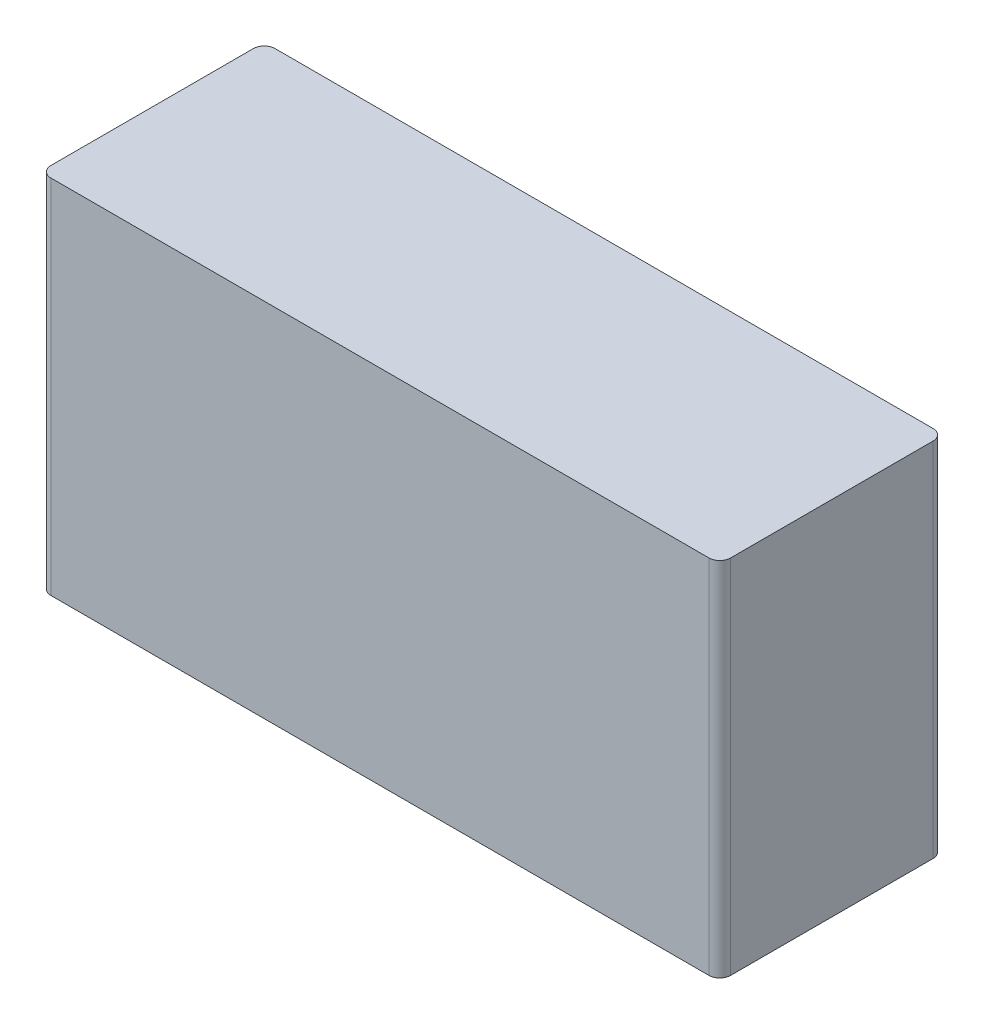
ISO-10303-21;
HEADER;
FILE_DESCRIPTION(('STEP AP214'),'2;1');
FILE_NAME('part.step','',(''),(''),'','','');
FILE_SCHEMA(('AUTOMOTIVE_DESIGN { 1 0 10303 214 1 1 1 1 }'));
ENDSEC;
DATA;
#1=APPLICATION_CONTEXT('core data for automotive mechanical design processes');
#2=APPLICATION_PROTOCOL_DEFINITION('international standard','automotive_design',2000,#1);
#3=PRODUCT_CONTEXT('',#1,'mechanical');
#4=PRODUCT('Part','Part','',(#3));
#5=PRODUCT_RELATED_PRODUCT_CATEGORY('part','',(#4));
#6=PRODUCT_DEFINITION_FORMATION('','',#4);
#7=PRODUCT_DEFINITION_CONTEXT('part definition',#1,'design');
#8=PRODUCT_DEFINITION('design','',#6,#7);
#9=PRODUCT_DEFINITION_SHAPE('','',#8);
#10=(LENGTH_UNIT() NAMED_UNIT(*) SI_UNIT(.MILLI.,.METRE.));
#11=(NAMED_UNIT(*) PLANE_ANGLE_UNIT() SI_UNIT($,.RADIAN.));
#12=(NAMED_UNIT(*) SI_UNIT($,.STERADIAN.) SOLID_ANGLE_UNIT());
#13=UNCERTAINTY_MEASURE_WITH_UNIT(LENGTH_MEASURE(1.E-05),#10,'distance_accuracy_value','');
#14=(GEOMETRIC_REPRESENTATION_CONTEXT(3) GLOBAL_UNCERTAINTY_ASSIGNED_CONTEXT((#13)) GLOBAL_UNIT_ASSIGNED_CONTEXT((#10,
#11,#12)) REPRESENTATION_CONTEXT('',''));
#15=CARTESIAN_POINT('',(0.,0.,0.));
#16=DIRECTION('',(0.,0.,1.));
#17=DIRECTION('',(1.,0.,0.));
#18=AXIS2_PLACEMENT_3D('',#15,#16,#17);
#19=CARTESIAN_POINT('',(0.,-0.25,0.185));
#20=DIRECTION('',(0.,1.,0.));
#21=DIRECTION('',(0.,0.,1.));
#22=AXIS2_PLACEMENT_3D('',#19,#20,#21);
#23=PLANE('',#22);
#24=DIRECTION('',(-1.,0.,0.));
#25=VECTOR('',#24,1.);
#26=CARTESIAN_POINT('',(-0.455,-0.25,0.340000000000001));
#27=LINE('',#26,#25);
#28=CARTESIAN_POINT('',(0.455,-0.25,0.34));
#29=VERTEX_POINT('',#28);
#30=CARTESIAN_POINT('',(-0.455,-0.25,0.340000000000001));
#31=VERTEX_POINT('',#30);
#32=EDGE_CURVE('E11',#29,#31,#27,.T.);
#33=ORIENTED_EDGE('',*,*,#32,.T.);
#34=CARTESIAN_POINT('',(-0.455,-0.25,0.325000000000001));
#35=DIRECTION('',(0.,-1.,0.));
#36=DIRECTION('',(-1.,0.,0.));
#37=AXIS2_PLACEMENT_3D('',#34,#35,#36);
#38=CIRCLE('',#37,0.015);
#39=CARTESIAN_POINT('',(-0.47,-0.25,0.325000000000001));
#40=VERTEX_POINT('',#39);
#41=EDGE_CURVE('E24',#31,#40,#38,.T.);
#42=ORIENTED_EDGE('',*,*,#41,.T.);
#43=DIRECTION('',(0.,0.,-1.));
#44=VECTOR('',#43,1.);
#45=CARTESIAN_POINT('',(-0.470000000000001,-0.25,0.045));
#46=LINE('',#45,#44);
#47=CARTESIAN_POINT('',(-0.470000000000001,-0.25,0.045));
#48=VERTEX_POINT('',#47);
#49=EDGE_CURVE('E141',#40,#48,#46,.T.);
#50=ORIENTED_EDGE('',*,*,#49,.T.);
#51=CARTESIAN_POINT('',(-0.455000000000001,-0.25,0.045));
#52=DIRECTION('',(0.,-1.,0.));
#53=DIRECTION('',(0.,0.,-1.));
#54=AXIS2_PLACEMENT_3D('',#51,#52,#53);
#55=CIRCLE('',#54,0.015);
#56=CARTESIAN_POINT('',(-0.455000000000001,-0.25,0.03));
#57=VERTEX_POINT('',#56);
#58=EDGE_CURVE('E139',#48,#57,#55,.T.);
#59=ORIENTED_EDGE('',*,*,#58,.T.);
#60=DIRECTION('',(1.,0.,0.));
#61=VECTOR('',#60,1.);
#62=CARTESIAN_POINT('',(0.455,-0.25,0.0299999999999999));
#63=LINE('',#62,#61);
#64=CARTESIAN_POINT('',(0.455,-0.25,0.0299999999999999));
#65=VERTEX_POINT('',#64);
#66=EDGE_CURVE('E137',#57,#65,#63,.T.);
#67=ORIENTED_EDGE('',*,*,#66,.T.);
#68=CARTESIAN_POINT('',(0.455,-0.25,0.0449999999999999));
#69=DIRECTION('',(0.,-1.,0.));
#70=DIRECTION('',(1.,0.,0.));
#71=AXIS2_PLACEMENT_3D('',#68,#69,#70);
#72=CIRCLE('',#71,0.015);
#73=CARTESIAN_POINT('',(0.47,-0.25,0.0449999999999999));
#74=VERTEX_POINT('',#73);
#75=EDGE_CURVE('E135',#65,#74,#72,.T.);
#76=ORIENTED_EDGE('',*,*,#75,.T.);
#77=DIRECTION('',(0.,0.,1.));
#78=VECTOR('',#77,1.);
#79=CARTESIAN_POINT('',(0.47,-0.25,0.325));
#80=LINE('',#79,#78);
#81=CARTESIAN_POINT('',(0.47,-0.25,0.325));
#82=VERTEX_POINT('',#81);
#83=EDGE_CURVE('E133',#74,#82,#80,.T.);
#84=ORIENTED_EDGE('',*,*,#83,.T.);
#85=CARTESIAN_POINT('',(0.455,-0.25,0.325));
#86=DIRECTION('',(0.,-1.,0.));
#87=DIRECTION('',(0.,0.,1.));
#88=AXIS2_PLACEMENT_3D('',#85,#86,#87);
#89=CIRCLE('',#88,0.015);
#90=EDGE_CURVE('E131',#82,#29,#89,.T.);
#91=ORIENTED_EDGE('',*,*,#90,.T.);
#92=EDGE_LOOP('',(#33,#42,#50,#59,#67,#76,#84,#91));
#93=FACE_BOUND('',#92,.T.);
#94=ADVANCED_FACE('F17',(#93),#23,.F.);
#95=CARTESIAN_POINT('',(-0.455,0.,0.325000000000001));
#96=DIRECTION('',(0.,1.,0.));
#97=DIRECTION('',(-1.,0.,0.));
#98=AXIS2_PLACEMENT_3D('',#95,#96,#97);
#99=CYLINDRICAL_SURFACE('',#98,0.015);
#100=DIRECTION('',(0.,-1.,0.));
#101=VECTOR('',#100,1.);
#102=CARTESIAN_POINT('',(-0.455,0.,0.340000000000001));
#103=LINE('',#102,#101);
#104=CARTESIAN_POINT('',(-0.455,0.25,0.340000000000001));
#105=VERTEX_POINT('',#104);
#106=EDGE_CURVE('E129',#105,#31,#103,.T.);
#107=ORIENTED_EDGE('',*,*,#106,.F.);
#108=CARTESIAN_POINT('',(-0.455,0.25,0.325000000000001));
#109=DIRECTION('',(0.,1.,0.));
#110=DIRECTION('',(-1.,0.,0.));
#111=AXIS2_PLACEMENT_3D('',#108,#109,#110);
#112=CIRCLE('',#111,0.015);
#113=CARTESIAN_POINT('',(-0.47,0.25,0.325000000000001));
#114=VERTEX_POINT('',#113);
#115=EDGE_CURVE('E96',#114,#105,#112,.T.);
#116=ORIENTED_EDGE('',*,*,#115,.F.);
#117=DIRECTION('',(0.,1.,0.));
#118=VECTOR('',#117,1.);
#119=CARTESIAN_POINT('',(-0.47,0.,0.325000000000001));
#120=LINE('',#119,#118);
#121=EDGE_CURVE('E125',#40,#114,#120,.T.);
#122=ORIENTED_EDGE('',*,*,#121,.F.);
#123=ORIENTED_EDGE('',*,*,#41,.F.);
#124=EDGE_LOOP('',(#107,#116,#122,#123));
#125=FACE_BOUND('',#124,.T.);
#126=ADVANCED_FACE('F149',(#125),#99,.T.);
#127=CARTESIAN_POINT('',(-0.470000000000001,0.,0.045));
#128=DIRECTION('',(-1.,0.,0.));
#129=DIRECTION('',(0.,0.,1.));
#130=AXIS2_PLACEMENT_3D('',#127,#128,#129);
#131=PLANE('',#130);
#132=ORIENTED_EDGE('',*,*,#121,.T.);
#133=DIRECTION('',(0.,0.,1.));
#134=VECTOR('',#133,1.);
#135=CARTESIAN_POINT('',(-0.470000000000001,0.25,0.045));
#136=LINE('',#135,#134);
#137=CARTESIAN_POINT('',(-0.470000000000001,0.25,0.045));
#138=VERTEX_POINT('',#137);
#139=EDGE_CURVE('E123',#138,#114,#136,.T.);
#140=ORIENTED_EDGE('',*,*,#139,.F.);
#141=DIRECTION('',(0.,1.,0.));
#142=VECTOR('',#141,1.);
#143=CARTESIAN_POINT('',(-0.470000000000001,0.,0.045));
#144=LINE('',#143,#142);
#145=EDGE_CURVE('E120',#48,#138,#144,.T.);
#146=ORIENTED_EDGE('',*,*,#145,.F.);
#147=ORIENTED_EDGE('',*,*,#49,.F.);
#148=EDGE_LOOP('',(#132,#140,#146,#147));
#149=FACE_BOUND('',#148,.T.);
#150=ADVANCED_FACE('F148',(#149),#131,.T.);
#151=CARTESIAN_POINT('',(-0.455000000000001,0.,0.045));
#152=DIRECTION('',(0.,1.,0.));
#153=DIRECTION('',(0.,0.,-1.));
#154=AXIS2_PLACEMENT_3D('',#151,#152,#153);
#155=CYLINDRICAL_SURFACE('',#154,0.015);
#156=ORIENTED_EDGE('',*,*,#145,.T.);
#157=CARTESIAN_POINT('',(-0.455000000000001,0.25,0.045));
#158=DIRECTION('',(0.,1.,0.));
#159=DIRECTION('',(0.,0.,-1.));
#160=AXIS2_PLACEMENT_3D('',#157,#158,#159);
#161=CIRCLE('',#160,0.015);
#162=CARTESIAN_POINT('',(-0.455000000000001,0.25,0.03));
#163=VERTEX_POINT('',#162);
#164=EDGE_CURVE('E117',#163,#138,#161,.T.);
#165=ORIENTED_EDGE('',*,*,#164,.F.);
#166=DIRECTION('',(0.,1.,0.));
#167=VECTOR('',#166,1.);
#168=CARTESIAN_POINT('',(-0.455000000000001,0.,0.03));
#169=LINE('',#168,#167);
#170=EDGE_CURVE('E114',#57,#163,#169,.T.);
#171=ORIENTED_EDGE('',*,*,#170,.F.);
#172=ORIENTED_EDGE('',*,*,#58,.F.);
#173=EDGE_LOOP('',(#156,#165,#171,#172));
#174=FACE_BOUND('',#173,.T.);
#175=ADVANCED_FACE('F156',(#174),#155,.T.);
#176=CARTESIAN_POINT('',(0.455,0.,0.0299999999999999));
#177=DIRECTION('',(0.,0.,-1.));
#178=DIRECTION('',(-1.,0.,0.));
#179=AXIS2_PLACEMENT_3D('',#176,#177,#178);
#180=PLANE('',#179);
#181=ORIENTED_EDGE('',*,*,#170,.T.);
#182=DIRECTION('',(-1.,0.,0.));
#183=VECTOR('',#182,1.);
#184=CARTESIAN_POINT('',(0.455,0.25,0.0299999999999999));
#185=LINE('',#184,#183);
#186=CARTESIAN_POINT('',(0.455,0.25,0.0299999999999999));
#187=VERTEX_POINT('',#186);
#188=EDGE_CURVE('E111',#187,#163,#185,.T.);
#189=ORIENTED_EDGE('',*,*,#188,.F.);
#190=DIRECTION('',(0.,1.,0.));
#191=VECTOR('',#190,1.);
#192=CARTESIAN_POINT('',(0.455,0.,0.0299999999999999));
#193=LINE('',#192,#191);
#194=EDGE_CURVE('E108',#65,#187,#193,.T.);
#195=ORIENTED_EDGE('',*,*,#194,.F.);
#196=ORIENTED_EDGE('',*,*,#66,.F.);
#197=EDGE_LOOP('',(#181,#189,#195,#196));
#198=FACE_BOUND('',#197,.T.);
#199=ADVANCED_FACE('F161',(#198),#180,.T.);
#200=CARTESIAN_POINT('',(0.455,0.,0.0449999999999999));
#201=DIRECTION('',(0.,1.,0.));
#202=DIRECTION('',(1.,0.,0.));
#203=AXIS2_PLACEMENT_3D('',#200,#201,#202);
#204=CYLINDRICAL_SURFACE('',#203,0.015);
#205=ORIENTED_EDGE('',*,*,#194,.T.);
#206=CARTESIAN_POINT('',(0.455,0.25,0.0449999999999999));
#207=DIRECTION('',(0.,1.,0.));
#208=DIRECTION('',(1.,0.,0.));
#209=AXIS2_PLACEMENT_3D('',#206,#207,#208);
#210=CIRCLE('',#209,0.015);
#211=CARTESIAN_POINT('',(0.47,0.25,0.0449999999999999));
#212=VERTEX_POINT('',#211);
#213=EDGE_CURVE('E105',#212,#187,#210,.T.);
#214=ORIENTED_EDGE('',*,*,#213,.F.);
#215=DIRECTION('',(0.,1.,0.));
#216=VECTOR('',#215,1.);
#217=CARTESIAN_POINT('',(0.47,0.,0.0449999999999999));
#218=LINE('',#217,#216);
#219=EDGE_CURVE('E102',#74,#212,#218,.T.);
#220=ORIENTED_EDGE('',*,*,#219,.F.);
#221=ORIENTED_EDGE('',*,*,#75,.F.);
#222=EDGE_LOOP('',(#205,#214,#220,#221));
#223=FACE_BOUND('',#222,.T.);
#224=ADVANCED_FACE('F165',(#223),#204,.T.);
#225=CARTESIAN_POINT('',(0.47,0.,0.325));
#226=DIRECTION('',(1.,0.,0.));
#227=DIRECTION('',(0.,0.,-1.));
#228=AXIS2_PLACEMENT_3D('',#225,#226,#227);
#229=PLANE('',#228);
#230=ORIENTED_EDGE('',*,*,#219,.T.);
#231=DIRECTION('',(0.,0.,-1.));
#232=VECTOR('',#231,1.);
#233=CARTESIAN_POINT('',(0.47,0.25,0.325));
#234=LINE('',#233,#232);
#235=CARTESIAN_POINT('',(0.47,0.25,0.325));
#236=VERTEX_POINT('',#235);
#237=EDGE_CURVE('E100',#236,#212,#234,.T.);
#238=ORIENTED_EDGE('',*,*,#237,.F.);
#239=DIRECTION('',(0.,1.,0.));
#240=VECTOR('',#239,1.);
#241=CARTESIAN_POINT('',(0.47,0.,0.325));
#242=LINE('',#241,#240);
#243=EDGE_CURVE('E84',#82,#236,#242,.T.);
#244=ORIENTED_EDGE('',*,*,#243,.F.);
#245=ORIENTED_EDGE('',*,*,#83,.F.);
#246=EDGE_LOOP('',(#230,#238,#244,#245));
#247=FACE_BOUND('',#246,.T.);
#248=ADVANCED_FACE('F169',(#247),#229,.T.);
#249=CARTESIAN_POINT('',(0.455,0.,0.325));
#250=DIRECTION('',(0.,1.,0.));
#251=DIRECTION('',(0.,0.,1.));
#252=AXIS2_PLACEMENT_3D('',#249,#250,#251);
#253=CYLINDRICAL_SURFACE('',#252,0.015);
#254=ORIENTED_EDGE('',*,*,#243,.T.);
#255=CARTESIAN_POINT('',(0.455,0.25,0.325));
#256=DIRECTION('',(0.,1.,0.));
#257=DIRECTION('',(0.,0.,1.));
#258=AXIS2_PLACEMENT_3D('',#255,#256,#257);
#259=CIRCLE('',#258,0.015);
#260=CARTESIAN_POINT('',(0.455,0.25,0.34));
#261=VERTEX_POINT('',#260);
#262=EDGE_CURVE('E79',#261,#236,#259,.T.);
#263=ORIENTED_EDGE('',*,*,#262,.F.);
#264=DIRECTION('',(0.,1.,0.));
#265=VECTOR('',#264,1.);
#266=CARTESIAN_POINT('',(0.455,0.,0.34));
#267=LINE('',#266,#265);
#268=EDGE_CURVE('E82',#29,#261,#267,.T.);
#269=ORIENTED_EDGE('',*,*,#268,.F.);
#270=ORIENTED_EDGE('',*,*,#90,.F.);
#271=EDGE_LOOP('',(#254,#263,#269,#270));
#272=FACE_BOUND('',#271,.T.);
#273=ADVANCED_FACE('F80',(#272),#253,.T.);
#274=CARTESIAN_POINT('',(-0.455,0.,0.340000000000001));
#275=DIRECTION('',(0.,0.,1.));
#276=DIRECTION('',(1.,0.,0.));
#277=AXIS2_PLACEMENT_3D('',#274,#275,#276);
#278=PLANE('',#277);
#279=ORIENTED_EDGE('',*,*,#268,.T.);
#280=DIRECTION('',(1.,0.,0.));
#281=VECTOR('',#280,1.);
#282=CARTESIAN_POINT('',(-0.455,0.25,0.340000000000001));
#283=LINE('',#282,#281);
#284=EDGE_CURVE('E91',#105,#261,#283,.T.);
#285=ORIENTED_EDGE('',*,*,#284,.F.);
#286=ORIENTED_EDGE('',*,*,#106,.T.);
#287=ORIENTED_EDGE('',*,*,#32,.F.);
#288=EDGE_LOOP('',(#279,#285,#286,#287));
#289=FACE_BOUND('',#288,.T.);
#290=ADVANCED_FACE('F90',(#289),#278,.T.);
#291=CARTESIAN_POINT('',(0.,0.25,0.185));
#292=DIRECTION('',(0.,1.,0.));
#293=DIRECTION('',(0.,0.,1.));
#294=AXIS2_PLACEMENT_3D('',#291,#292,#293);
#295=PLANE('',#294);
#296=ORIENTED_EDGE('',*,*,#284,.T.);
#297=ORIENTED_EDGE('',*,*,#262,.T.);
#298=ORIENTED_EDGE('',*,*,#237,.T.);
#299=ORIENTED_EDGE('',*,*,#213,.T.);
#300=ORIENTED_EDGE('',*,*,#188,.T.);
#301=ORIENTED_EDGE('',*,*,#164,.T.);
#302=ORIENTED_EDGE('',*,*,#139,.T.);
#303=ORIENTED_EDGE('',*,*,#115,.T.);
#304=EDGE_LOOP('',(#296,#297,#298,#299,#300,#301,#302,#303));
#305=FACE_BOUND('',#304,.T.);
#306=ADVANCED_FACE('F94',(#305),#295,.T.);
#307=CLOSED_SHELL('',(#94,#126,#150,#175,#199,#224,#248,#273,#290,#306));
#308=MANIFOLD_SOLID_BREP('B1',#307);
#309=ADVANCED_BREP_SHAPE_REPRESENTATION('',(#18,#308),#14);
#310=SHAPE_DEFINITION_REPRESENTATION(#9,#309);
ENDSEC;
END-ISO-10303-21;
